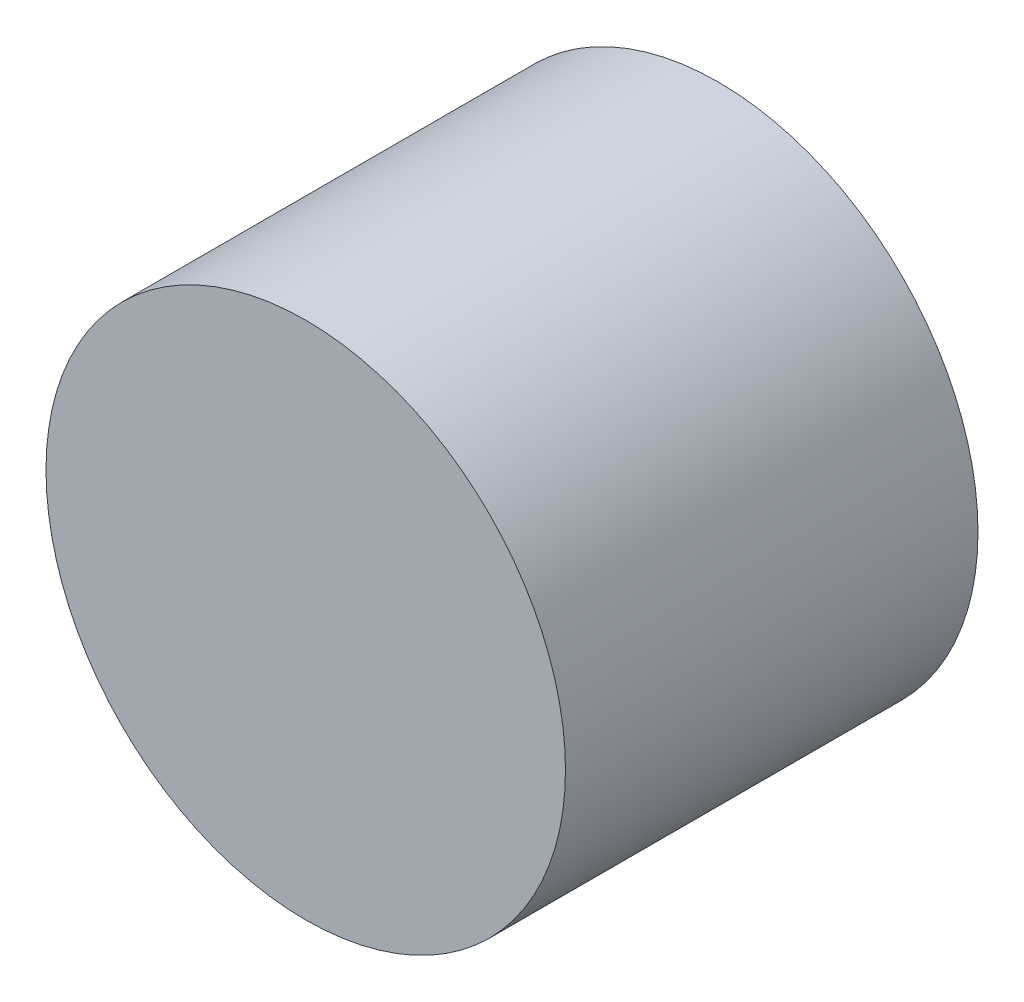
ISO-10303-21;
HEADER;
FILE_DESCRIPTION(('STEP AP214'),'2;1');
FILE_NAME('part.step','',(''),(''),'','','');
FILE_SCHEMA(('AUTOMOTIVE_DESIGN { 1 0 10303 214 1 1 1 1 }'));
ENDSEC;
DATA;
#1=APPLICATION_CONTEXT('core data for automotive mechanical design processes');
#2=APPLICATION_PROTOCOL_DEFINITION('international standard','automotive_design',2000,#1);
#3=PRODUCT_CONTEXT('',#1,'mechanical');
#4=PRODUCT('Part','Part','',(#3));
#5=PRODUCT_RELATED_PRODUCT_CATEGORY('part','',(#4));
#6=PRODUCT_DEFINITION_FORMATION('','',#4);
#7=PRODUCT_DEFINITION_CONTEXT('part definition',#1,'design');
#8=PRODUCT_DEFINITION('design','',#6,#7);
#9=PRODUCT_DEFINITION_SHAPE('','',#8);
#10=(LENGTH_UNIT() NAMED_UNIT(*) SI_UNIT(.MILLI.,.METRE.));
#11=(NAMED_UNIT(*) PLANE_ANGLE_UNIT() SI_UNIT($,.RADIAN.));
#12=(NAMED_UNIT(*) SI_UNIT($,.STERADIAN.) SOLID_ANGLE_UNIT());
#13=UNCERTAINTY_MEASURE_WITH_UNIT(LENGTH_MEASURE(1.E-05),#10,'distance_accuracy_value','');
#14=(GEOMETRIC_REPRESENTATION_CONTEXT(3) GLOBAL_UNCERTAINTY_ASSIGNED_CONTEXT((#13)) GLOBAL_UNIT_ASSIGNED_CONTEXT((#10,
#11,#12)) REPRESENTATION_CONTEXT('',''));
#15=CARTESIAN_POINT('',(0.,0.,0.));
#16=DIRECTION('',(0.,0.,1.));
#17=DIRECTION('',(1.,0.,0.));
#18=AXIS2_PLACEMENT_3D('',#15,#16,#17);
#19=CARTESIAN_POINT('',(0.,0.,13.5));
#20=DIRECTION('',(0.,0.,-1.));
#21=DIRECTION('',(-1.,0.,0.));
#22=AXIS2_PLACEMENT_3D('',#19,#20,#21);
#23=CYLINDRICAL_SURFACE('',#22,8.5);
#24=CARTESIAN_POINT('',(0.,0.,13.5));
#25=DIRECTION('',(0.,0.,1.));
#26=DIRECTION('',(1.,0.,0.));
#27=AXIS2_PLACEMENT_3D('',#24,#25,#26);
#28=CIRCLE('',#27,8.5);
#29=CARTESIAN_POINT('',(8.5,0.,13.5));
#30=VERTEX_POINT('',#29);
#31=EDGE_CURVE('E10',#30,#30,#28,.T.);
#32=ORIENTED_EDGE('',*,*,#31,.F.);
#33=EDGE_LOOP('',(#32));
#34=FACE_BOUND('',#33,.T.);
#35=CARTESIAN_POINT('',(0.,0.,0.));
#36=DIRECTION('',(0.,0.,1.));
#37=DIRECTION('',(1.,0.,0.));
#38=AXIS2_PLACEMENT_3D('',#35,#36,#37);
#39=CIRCLE('',#38,8.5);
#40=CARTESIAN_POINT('',(8.5,0.,0.));
#41=VERTEX_POINT('',#40);
#42=EDGE_CURVE('E34',#41,#41,#39,.T.);
#43=ORIENTED_EDGE('',*,*,#42,.T.);
#44=EDGE_LOOP('',(#43));
#45=FACE_BOUND('',#44,.T.);
#46=ADVANCED_FACE('F31',(#34,#45),#23,.T.);
#47=CARTESIAN_POINT('',(0.,0.,13.5));
#48=DIRECTION('',(0.,0.,1.));
#49=DIRECTION('',(1.,0.,0.));
#50=AXIS2_PLACEMENT_3D('',#47,#48,#49);
#51=PLANE('',#50);
#52=ORIENTED_EDGE('',*,*,#31,.T.);
#53=EDGE_LOOP('',(#52));
#54=FACE_BOUND('',#53,.T.);
#55=ADVANCED_FACE('F46',(#54),#51,.T.);
#56=CARTESIAN_POINT('',(0.,0.,0.));
#57=DIRECTION('',(0.,0.,1.));
#58=DIRECTION('',(1.,0.,0.));
#59=AXIS2_PLACEMENT_3D('',#56,#57,#58);
#60=PLANE('',#59);
#61=ORIENTED_EDGE('',*,*,#42,.F.);
#62=EDGE_LOOP('',(#61));
#63=FACE_BOUND('',#62,.T.);
#64=ADVANCED_FACE('F44',(#63),#60,.F.);
#65=CLOSED_SHELL('',(#46,#55,#64));
#66=MANIFOLD_SOLID_BREP('B2',#65);
#67=ADVANCED_BREP_SHAPE_REPRESENTATION('',(#18,#66),#14);
#68=SHAPE_DEFINITION_REPRESENTATION(#9,#67);
ENDSEC;
END-ISO-10303-21;
